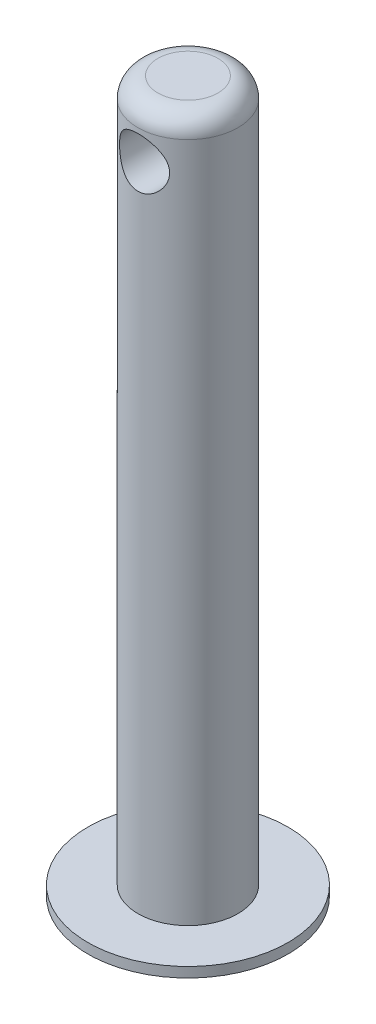
ISO-10303-21;
HEADER;
FILE_DESCRIPTION(('STEP AP214'),'2;1');
FILE_NAME('part.step','',(''),(''),'','','');
FILE_SCHEMA(('AUTOMOTIVE_DESIGN { 1 0 10303 214 1 1 1 1 }'));
ENDSEC;
DATA;
#1=APPLICATION_CONTEXT('core data for automotive mechanical design processes');
#2=APPLICATION_PROTOCOL_DEFINITION('international standard','automotive_design',2000,#1);
#3=PRODUCT_CONTEXT('',#1,'mechanical');
#4=PRODUCT('Part','Part','',(#3));
#5=PRODUCT_RELATED_PRODUCT_CATEGORY('part','',(#4));
#6=PRODUCT_DEFINITION_FORMATION('','',#4);
#7=PRODUCT_DEFINITION_CONTEXT('part definition',#1,'design');
#8=PRODUCT_DEFINITION('design','',#6,#7);
#9=PRODUCT_DEFINITION_SHAPE('','',#8);
#10=(LENGTH_UNIT() NAMED_UNIT(*) SI_UNIT(.MILLI.,.METRE.));
#11=(NAMED_UNIT(*) PLANE_ANGLE_UNIT() SI_UNIT($,.RADIAN.));
#12=(NAMED_UNIT(*) SI_UNIT($,.STERADIAN.) SOLID_ANGLE_UNIT());
#13=UNCERTAINTY_MEASURE_WITH_UNIT(LENGTH_MEASURE(1.E-05),#10,'distance_accuracy_value','');
#14=(GEOMETRIC_REPRESENTATION_CONTEXT(3) GLOBAL_UNCERTAINTY_ASSIGNED_CONTEXT((#13)) GLOBAL_UNIT_ASSIGNED_CONTEXT((#10,
#11,#12)) REPRESENTATION_CONTEXT('',''));
#15=CARTESIAN_POINT('',(0.,0.,0.));
#16=DIRECTION('',(0.,0.,1.));
#17=DIRECTION('',(1.,0.,0.));
#18=AXIS2_PLACEMENT_3D('',#15,#16,#17);
#19=CARTESIAN_POINT('',(0.,70.,0.));
#20=DIRECTION('',(0.,-1.,0.));
#21=DIRECTION('',(0.,0.,-1.));
#22=AXIS2_PLACEMENT_3D('',#19,#20,#21);
#23=CYLINDRICAL_SURFACE('',#22,5.);
#24=CARTESIAN_POINT('',(0.,67.5,-5.));
#25=CARTESIAN_POINT('',(-0.131426682334305,67.499990330944,-4.99999177550472));
#26=CARTESIAN_POINT('',(-0.263015634437213,67.489574438226,-4.99476199135277));
#27=CARTESIAN_POINT('',(-0.522301454622884,67.448368178838,-4.9743541856102));
#28=CARTESIAN_POINT('',(-0.649990448564106,67.417539119075,-4.9591572718767));
#29=CARTESIAN_POINT('',(-0.897333631316202,67.3370153772812,-4.92040690922477));
#30=CARTESIAN_POINT('',(-1.01701694536277,67.2873940122173,-4.89688595907259));
#31=CARTESIAN_POINT('',(-1.2461816039967,67.1710734737482,-4.84364443325827));
#32=CARTESIAN_POINT('',(-1.35566375203769,67.1043756468549,-4.81392434644421));
#33=CARTESIAN_POINT('',(-1.56876952630997,66.9512068683574,-4.74890645050632));
#34=CARTESIAN_POINT('',(-1.67163802294308,66.8637837997702,-4.71337997659091));
#35=CARTESIAN_POINT('',(-1.86194861703332,66.6736963040147,-4.64149925776731));
#36=CARTESIAN_POINT('',(-1.94937895911555,66.5710203711599,-4.60514440566897));
#37=CARTESIAN_POINT('',(-2.11312999967247,66.3437916255547,-4.53247377945621));
#38=CARTESIAN_POINT('',(-2.18806333849064,66.218159753965,-4.49637967412567));
#39=CARTESIAN_POINT('',(-2.31542056761491,65.9540816602046,-4.43214946943555));
#40=CARTESIAN_POINT('',(-2.36786053751683,65.8156446782374,-4.40400769020792));
#41=CARTESIAN_POINT('',(-2.44533110537653,65.5383372364036,-4.36144667591402));
#42=CARTESIAN_POINT('',(-2.47181464267578,65.3999888698204,-4.34630678958452));
#43=CARTESIAN_POINT('',(-2.50106748329741,65.1200529055624,-4.3295472487215));
#44=CARTESIAN_POINT('',(-2.50386022093906,64.9784686478249,-4.3279142335843));
#45=CARTESIAN_POINT('',(-2.48671821792512,64.7142849392091,-4.33777325642937));
#46=CARTESIAN_POINT('',(-2.46946139884055,64.5914399219417,-4.34771909154984));
#47=CARTESIAN_POINT('',(-2.41734962264384,64.3506952265681,-4.37690571834675));
#48=CARTESIAN_POINT('',(-2.38248905974454,64.2327971367369,-4.39614947079454));
#49=CARTESIAN_POINT('',(-2.2955244509646,64.0019271685857,-4.44218691031838));
#50=CARTESIAN_POINT('',(-2.24303766778988,63.8891340030355,-4.46914601659992));
#51=CARTESIAN_POINT('',(-2.12260421917012,63.673414268525,-4.52758510703513));
#52=CARTESIAN_POINT('',(-2.0546506095312,63.5704921609998,-4.55906711950477));
#53=CARTESIAN_POINT('',(-1.89516513728194,63.3636968681419,-4.62782894758213));
#54=CARTESIAN_POINT('',(-1.8017361459232,63.2613578160596,-4.66533775591865));
#55=CARTESIAN_POINT('',(-1.59888894685345,63.0731614535228,-4.73869058251018));
#56=CARTESIAN_POINT('',(-1.48946314143572,62.9873120199153,-4.77453379897003));
#57=CARTESIAN_POINT('',(-1.25129126457963,62.8307858474257,-4.84254968207409));
#58=CARTESIAN_POINT('',(-1.12188397899854,62.7609988188857,-4.87447460405015));
#59=CARTESIAN_POINT('',(-0.851165538721991,62.6447574273925,-4.92894702803108));
#60=CARTESIAN_POINT('',(-0.709863940663166,62.5982845374621,-4.95150197358893));
#61=CARTESIAN_POINT('',(-0.431916229151783,62.5338114907083,-4.98310834353579));
#62=CARTESIAN_POINT('',(-0.295853826370908,62.513771910633,-4.9931234575324));
#63=CARTESIAN_POINT('',(-0.0219489998732904,62.4963381721638,-5.00182533647794));
#64=CARTESIAN_POINT('',(0.115892549675108,62.4989332859015,-5.00051746803426));
#65=CARTESIAN_POINT('',(0.378082429964654,62.5255167210467,-4.98727980633468));
#66=CARTESIAN_POINT('',(0.502648520123704,62.5478313318244,-4.97618114219992));
#67=CARTESIAN_POINT('',(0.74601723075597,62.6105951797384,-4.94555428287529));
#68=CARTESIAN_POINT('',(0.864819214231882,62.6510464161359,-4.92602515837625));
#69=CARTESIAN_POINT('',(1.09722152111965,62.7499961660804,-4.87960628532329));
#70=CARTESIAN_POINT('',(1.21057599249831,62.8089776252823,-4.85252204417873));
#71=CARTESIAN_POINT('',(1.42615340426439,62.9427688391248,-4.7935993579975));
#72=CARTESIAN_POINT('',(1.52837157450204,63.0175853365199,-4.76175888940534));
#73=CARTESIAN_POINT('',(1.72941922315487,63.1894010632909,-4.69270553315086));
#74=CARTESIAN_POINT('',(1.82693019428496,63.2878571709752,-4.65527212009488));
#75=CARTESIAN_POINT('',(2.0046408025722,63.4998128780494,-4.58155978921587));
#76=CARTESIAN_POINT('',(2.08482846428685,63.6133227970699,-4.54528168472407));
#77=CARTESIAN_POINT('',(2.22926978618995,63.8591091354847,-4.4762798054528));
#78=CARTESIAN_POINT('',(2.29256373922244,63.9920281652911,-4.44381323981254));
#79=CARTESIAN_POINT('',(2.39520706511459,64.2687751688825,-4.38935180726746));
#80=CARTESIAN_POINT('',(2.43458729077056,64.412588816,-4.36734345549014));
#81=CARTESIAN_POINT('',(2.48465421767006,64.6922755573629,-4.33903752569351));
#82=CARTESIAN_POINT('',(2.49773248744361,64.827585634119,-4.33143458674096));
#83=CARTESIAN_POINT('',(2.50172288950899,65.0986176673807,-4.32913386592579));
#84=CARTESIAN_POINT('',(2.49264462983266,65.2343394198736,-4.3344304902511));
#85=CARTESIAN_POINT('',(2.45481530197332,65.4887087556169,-4.35594655164663));
#86=CARTESIAN_POINT('',(2.42802074302696,65.6077511817208,-4.37107736338133));
#87=CARTESIAN_POINT('',(2.35793843840544,65.8395202922,-4.40927540337602));
#88=CARTESIAN_POINT('',(2.31464538728732,65.9522449315665,-4.43234518434965));
#89=CARTESIAN_POINT('',(2.20953919315538,66.1765621527197,-4.48571326433412));
#90=CARTESIAN_POINT('',(2.14667719009403,66.287569851735,-4.5163930799845));
#91=CARTESIAN_POINT('',(2.0053780838799,66.4981862432401,-4.58088327077455));
#92=CARTESIAN_POINT('',(1.92693287765888,66.5977889626287,-4.61469526970767));
#93=CARTESIAN_POINT('',(1.74550556946066,66.7953553637496,-4.68655816327011));
#94=CARTESIAN_POINT('',(1.6407002246921,66.8916493641714,-4.7246249151498));
#95=CARTESIAN_POINT('',(1.41539785420684,67.065655849428,-4.79694347383545));
#96=CARTESIAN_POINT('',(1.29489242426332,67.1433583186059,-4.83119321905446));
#97=CARTESIAN_POINT('',(1.03978808878537,67.2780969794841,-4.89245149457782));
#98=CARTESIAN_POINT('',(0.905095560782287,67.3349831677845,-4.91940711437488));
#99=CARTESIAN_POINT('',(0.696328709257349,67.4021838587924,-4.95177960923351));
#100=CARTESIAN_POINT('',(0.625670413494087,67.4215553980018,-4.96122314081874));
#101=CARTESIAN_POINT('',(0.482623997839258,67.4540659483706,-4.97717127275101));
#102=CARTESIAN_POINT('',(0.410236963092404,67.4672087666764,-4.98367766823159));
#103=CARTESIAN_POINT('',(0.281518684621675,67.4847374722846,-4.9923820076613));
#104=CARTESIAN_POINT('',(0.225408499555448,67.4904549365313,-4.99523288466454));
#105=CARTESIAN_POINT('',(0.112875528456291,67.4980883294657,-4.99904367329659));
#106=CARTESIAN_POINT('',(0.056452733838219,67.5000041532255,-5.00000353273198));
#107=CARTESIAN_POINT('',(0.,67.5,-5.));
#108=B_SPLINE_CURVE_WITH_KNOTS('',3,(#24,#25,#26,#27,#28,#29,#30,#31,#32,#33,#34,#35,#36,#37,
#38,#39,#40,#41,#42,#43,#44,#45,#46,#47,#48,#49,#50,#51,#52,#53,#54,#55,#56,#57,#58,#59,#60,#61,
#62,#63,#64,#65,#66,#67,#68,#69,#70,#71,#72,#73,#74,#75,#76,#77,#78,#79,#80,#81,#82,#83,#84,#85,
#86,#87,#88,#89,#90,#91,#92,#93,#94,#95,#96,#97,#98,#99,#100,#101,#102,#103,#104,#105,#106,
#107),.UNSPECIFIED.,.T.,.F.,(4,2,2,2,2,2,2,2,2,2,2,2,2,2,2,2,2,2,2,2,2,2,2,2,2,2,2,2,2,2,2,2,2,
2,2,2,2,2,2,2,2,4),(0.,0.394060643550733,0.788870374272993,1.18215538873074,1.57540940145392,
1.99245439679521,2.40981559413508,2.85954316076882,3.30894869745702,3.73145030350574,
4.15353393322552,4.52514281023302,4.89687009814194,5.27725600421219,5.65781303150554,
6.08662353334696,6.51563836496715,6.96457555536101,7.41315542280699,7.82458226178364,
8.23581411278691,8.61517266265305,8.99457304077329,9.38482140069747,9.77523626870849,
10.2039902661037,10.6330397153795,11.0828670540368,11.53211279863,11.9382326875699,
12.3441764966107,12.7114482562151,13.0788382197025,13.4709114195009,13.8631890285845,
14.303131068923,14.7433095845248,15.1866003415819,15.407934939208,15.6291340766843,
15.7983933645035,15.9676573239323),.UNSPECIFIED.);
#109=CARTESIAN_POINT('',(0.,67.5,-5.));
#110=VERTEX_POINT('',#109);
#111=EDGE_CURVE('E10',#110,#110,#108,.T.);
#112=ORIENTED_EDGE('',*,*,#111,.T.);
#113=EDGE_LOOP('',(#112));
#114=FACE_BOUND('',#113,.T.);
#115=CARTESIAN_POINT('',(2.5,65.,4.33012701892219));
#116=CARTESIAN_POINT('',(2.49998948436432,64.8697334931235,4.33013982272991));
#117=CARTESIAN_POINT('',(2.48974954513168,64.7392972793238,4.33609541965583));
#118=CARTESIAN_POINT('',(2.44930840724944,64.4824310284708,4.35905877051907));
#119=CARTESIAN_POINT('',(2.41906526369545,64.3560099959427,4.37608974726023));
#120=CARTESIAN_POINT('',(2.3402497699757,64.1113710544389,4.41873376871659));
#121=CARTESIAN_POINT('',(2.29177485369963,63.9931134264378,4.44430111338921));
#122=CARTESIAN_POINT('',(2.17816884056414,63.7664394369054,4.50106659111455));
#123=CARTESIAN_POINT('',(2.11303684262671,63.6580236082042,4.53226502875883));
#124=CARTESIAN_POINT('',(1.96166634317253,63.4442356960831,4.59992173524851));
#125=CARTESIAN_POINT('',(1.87413008816917,63.3398521655102,4.63660159331577));
#126=CARTESIAN_POINT('',(1.68313452122751,63.1464790242868,4.70929956727453));
#127=CARTESIAN_POINT('',(1.57966731506051,63.0574970922451,4.74531734512768));
#128=CARTESIAN_POINT('',(1.35122390789081,62.8915821235144,4.81553692452135));
#129=CARTESIAN_POINT('',(1.22526797235894,62.8158655807209,4.84945266064072));
#130=CARTESIAN_POINT('',(0.960392566671153,62.6871478665161,4.90876890230193));
#131=CARTESIAN_POINT('',(0.82148134538999,62.6341323595615,4.93417477954535));
#132=CARTESIAN_POINT('',(0.54511235977353,62.556238346836,4.9720115311507));
#133=CARTESIAN_POINT('',(0.408254476210989,62.5296261841349,4.98523700553425));
#134=CARTESIAN_POINT('',(0.131426571755681,62.4995847032887,5.00018959613973));
#135=CARTESIAN_POINT('',(-0.00854151460650369,62.4961413580046,5.00192366961168));
#136=CARTESIAN_POINT('',(-0.274581311061962,62.5118666849314,4.99407454791405));
#137=CARTESIAN_POINT('',(-0.400802997942672,62.5290950388045,4.98546239730476));
#138=CARTESIAN_POINT('',(-0.648284429795108,62.5822021097601,4.95935613149294));
#139=CARTESIAN_POINT('',(-0.769543802734622,62.6180822224402,4.94186135165964));
#140=CARTESIAN_POINT('',(-1.00577347892407,62.7077064152249,4.89928958219157));
#141=CARTESIAN_POINT('',(-1.120633558788,62.7616907829303,4.87411103823003));
#142=CARTESIAN_POINT('',(-1.33994200378327,62.8856585405036,4.81844114966712));
#143=CARTESIAN_POINT('',(-1.4443866220966,62.9556476582558,4.78794790393709));
#144=CARTESIAN_POINT('',(-1.65043415224549,63.1172383788326,4.72110985998075));
#145=CARTESIAN_POINT('',(-1.7508351875734,63.210257570815,4.68448439995438));
#146=CARTESIAN_POINT('',(-1.93526092574444,63.4114743123254,4.61135851467029));
#147=CARTESIAN_POINT('',(-2.01927302893557,63.5196834306851,4.57485820664072));
#148=CARTESIAN_POINT('',(-2.17376333660553,63.7566204810602,4.50360390231212));
#149=CARTESIAN_POINT('',(-2.24304328744513,63.8862150576355,4.46910799976769));
#150=CARTESIAN_POINT('',(-2.35829778250308,64.1573441783975,4.4093862569644));
#151=CARTESIAN_POINT('',(-2.40429664552722,64.2988660825439,4.38415075115168));
#152=CARTESIAN_POINT('',(-2.4679505275626,64.578036278207,4.34861589542586));
#153=CARTESIAN_POINT('',(-2.48756280529994,64.7151027976088,4.33729139621241));
#154=CARTESIAN_POINT('',(-2.50379236652857,64.9910033537913,4.32794798404024));
#155=CARTESIAN_POINT('',(-2.50042589328757,65.1298360727995,4.32991967223279));
#156=CARTESIAN_POINT('',(-2.47259010835991,65.3891347964468,4.34585841351462));
#157=CARTESIAN_POINT('',(-2.45046954178116,65.5099486277697,4.35848968766635));
#158=CARTESIAN_POINT('',(-2.38924071158112,65.7459194656775,4.39235053878353));
#159=CARTESIAN_POINT('',(-2.35012694655908,65.8610746268669,4.41358290012585));
#160=CARTESIAN_POINT('',(-2.25411897151217,66.0885283272564,4.46340555199141));
#161=CARTESIAN_POINT('',(-2.19648515923163,66.2004475421326,4.49229108107657));
#162=CARTESIAN_POINT('',(-2.0657176600397,66.4136731788488,4.55390298743125));
#163=CARTESIAN_POINT('',(-1.99257601083123,66.5149741087881,4.58663133387872));
#164=CARTESIAN_POINT('',(-1.82209291799636,66.7174469188033,4.65719996140836));
#165=CARTESIAN_POINT('',(-1.72286318078435,66.8169928767722,4.69516457885707));
#166=CARTESIAN_POINT('',(-1.5085112384988,66.9985305950059,4.76835587444746));
#167=CARTESIAN_POINT('',(-1.39338368664989,67.0805164256585,4.80358162519329));
#168=CARTESIAN_POINT('',(-1.14633840638508,67.2264343147909,4.86853404227334));
#169=CARTESIAN_POINT('',(-1.01405774389062,67.2898327952085,4.89809104179855));
#170=CARTESIAN_POINT('',(-0.738805911647338,67.392844759962,4.9470838739847));
#171=CARTESIAN_POINT('',(-0.595844253647071,67.4324791296051,4.96652859191746));
#172=CARTESIAN_POINT('',(-0.317449205674709,67.4834214093564,4.99168770453968));
#173=CARTESIAN_POINT('',(-0.18252860908538,67.4969946858304,4.99849819767838));
#174=CARTESIAN_POINT('',(0.087814964337426,67.5021081674946,5.00105325940467));
#175=CARTESIAN_POINT('',(0.223237748727012,67.4936560856611,4.99680170177041));
#176=CARTESIAN_POINT('',(0.481344982671068,67.4564589696045,4.97834922085637));
#177=CARTESIAN_POINT('',(0.604280801321767,67.4290878283637,4.96482236636807));
#178=CARTESIAN_POINT('',(0.843614873664449,67.3566825502417,4.92980234191731));
#179=CARTESIAN_POINT('',(0.960012187087208,67.3116458803664,4.90830802955518));
#180=CARTESIAN_POINT('',(1.18855854199592,67.2031821812607,4.85814826741488));
#181=CARTESIAN_POINT('',(1.30031295715362,67.1390509753102,4.82921542506803));
#182=CARTESIAN_POINT('',(1.51193650408535,66.9951058898524,4.76720333344986));
#183=CARTESIAN_POINT('',(1.61180014305397,66.9152848073731,4.73412218229104));
#184=CARTESIAN_POINT('',(1.80728542324369,66.7330042055506,4.66321523550925));
#185=CARTESIAN_POINT('',(1.90149582349002,66.6290822739993,4.62524489658367));
#186=CARTESIAN_POINT('',(2.07165660492503,66.4063847146178,4.55157698284941));
#187=CARTESIAN_POINT('',(2.1475908315154,66.2875960858008,4.51588143910584));
#188=CARTESIAN_POINT('',(2.28108393396028,66.0333638823358,4.44998982823926));
#189=CARTESIAN_POINT('',(2.3379862797745,65.8975126115754,4.42000320346984));
#190=CARTESIAN_POINT('',(2.40494911880459,65.6867773504802,4.38370272660093));
#191=CARTESIAN_POINT('',(2.42419582683991,65.6154402243024,4.37305486646054));
#192=CARTESIAN_POINT('',(2.45635087255789,65.4709593031507,4.35507574170935));
#193=CARTESIAN_POINT('',(2.46926364179177,65.3978168090456,4.34774215854234));
#194=CARTESIAN_POINT('',(2.48591166201423,65.2704990134531,4.3382377954292));
#195=CARTESIAN_POINT('',(2.49118864979203,65.2165836784878,4.33520487024791));
#196=CARTESIAN_POINT('',(2.49823512543934,65.1084553836896,4.33114674911323));
#197=CARTESIAN_POINT('',(2.50000437866475,65.0542424041894,4.33012168747261));
#198=CARTESIAN_POINT('',(2.5,65.,4.33012701892219));
#199=B_SPLINE_CURVE_WITH_KNOTS('',3,(#115,#116,#117,#118,#119,#120,#121,#122,#123,#124,#125,
#126,#127,#128,#129,#130,#131,#132,#133,#134,#135,#136,#137,#138,#139,#140,#141,#142,#143,#144,
#145,#146,#147,#148,#149,#150,#151,#152,#153,#154,#155,#156,#157,#158,#159,#160,#161,#162,#163,
#164,#165,#166,#167,#168,#169,#170,#171,#172,#173,#174,#175,#176,#177,#178,#179,#180,#181,#182,
#183,#184,#185,#186,#187,#188,#189,#190,#191,#192,#193,#194,#195,#196,#197,#198),.UNSPECIFIED.,
.T.,.F.,(4,2,2,2,2,2,2,2,2,2,2,2,2,2,2,2,2,2,2,2,2,2,2,2,2,2,2,2,2,2,2,2,2,2,2,2,2,2,2,2,2,4),
(0.,0.390580306486788,0.781982232062008,1.17132148982694,1.56068181366371,1.98215578129642,
2.40383927716011,2.85394730601992,3.30377067414811,3.72158712424921,4.13915059220183,
4.52040243716429,4.90168281298721,5.2882383683295,5.67493248380763,6.09817978647308,
6.52175120619879,6.97222104328704,7.42221935534346,7.83655727140611,8.25060232976016,
8.61935458565148,8.98822631095241,9.37418241020303,9.76033715555202,10.1951685895662,
10.6301466245059,11.076604535375,11.5226694952701,11.927806759788,12.3328021699001,
12.7111106218382,13.0894733378512,13.4840187680376,13.8787457525688,14.3127560463025,
14.7471485711797,15.195268726016,15.4189244153949,15.6424233996907,15.8050484542806,
15.9676843870379),.UNSPECIFIED.);
#200=CARTESIAN_POINT('',(2.5,65.,4.33012701892219));
#201=VERTEX_POINT('',#200);
#202=EDGE_CURVE('E43',#201,#201,#199,.T.);
#203=ORIENTED_EDGE('',*,*,#202,.T.);
#204=EDGE_LOOP('',(#203));
#205=FACE_BOUND('',#204,.T.);
#206=CARTESIAN_POINT('',(0.,68.,0.));
#207=DIRECTION('',(0.,1.,0.));
#208=DIRECTION('',(0.,0.,1.));
#209=AXIS2_PLACEMENT_3D('',#206,#207,#208);
#210=CIRCLE('',#209,5.);
#211=CARTESIAN_POINT('',(0.,68.,5.));
#212=VERTEX_POINT('',#211);
#213=EDGE_CURVE('E47',#212,#212,#210,.F.);
#214=ORIENTED_EDGE('',*,*,#213,.T.);
#215=EDGE_LOOP('',(#214));
#216=FACE_BOUND('',#215,.T.);
#217=CARTESIAN_POINT('',(0.,0.,0.));
#218=DIRECTION('',(0.,-1.,0.));
#219=DIRECTION('',(0.,0.,-1.));
#220=AXIS2_PLACEMENT_3D('',#217,#218,#219);
#221=CIRCLE('',#220,5.);
#222=CARTESIAN_POINT('',(0.,0.,-5.));
#223=VERTEX_POINT('',#222);
#224=EDGE_CURVE('E77',#223,#223,#221,.T.);
#225=ORIENTED_EDGE('',*,*,#224,.F.);
#226=EDGE_LOOP('',(#225));
#227=FACE_BOUND('',#226,.T.);
#228=ADVANCED_FACE('F33',(#114,#205,#216,#227),#23,.T.);
#229=CARTESIAN_POINT('',(0.,70.,0.));
#230=DIRECTION('',(0.,1.,0.));
#231=DIRECTION('',(0.,0.,1.));
#232=AXIS2_PLACEMENT_3D('',#229,#230,#231);
#233=PLANE('',#232);
#234=CARTESIAN_POINT('',(0.,70.,0.));
#235=DIRECTION('',(0.,1.,0.));
#236=DIRECTION('',(0.,0.,1.));
#237=AXIS2_PLACEMENT_3D('',#234,#235,#236);
#238=CIRCLE('',#237,3.);
#239=CARTESIAN_POINT('',(0.,70.,3.));
#240=VERTEX_POINT('',#239);
#241=EDGE_CURVE('E51',#240,#240,#238,.T.);
#242=ORIENTED_EDGE('',*,*,#241,.T.);
#243=EDGE_LOOP('',(#242));
#244=FACE_BOUND('',#243,.T.);
#245=ADVANCED_FACE('F65',(#244),#233,.T.);
#246=CARTESIAN_POINT('',(0.,68.,0.));
#247=DIRECTION('',(0.,1.,0.));
#248=DIRECTION('',(0.,0.,1.));
#249=AXIS2_PLACEMENT_3D('',#246,#247,#248);
#250=TOROIDAL_SURFACE('',#249,3.,2.);
#251=ORIENTED_EDGE('',*,*,#213,.F.);
#252=EDGE_LOOP('',(#251));
#253=FACE_BOUND('',#252,.T.);
#254=ORIENTED_EDGE('',*,*,#241,.F.);
#255=EDGE_LOOP('',(#254));
#256=FACE_BOUND('',#255,.T.);
#257=ADVANCED_FACE('F35',(#253,#256),#250,.T.);
#258=CARTESIAN_POINT('',(0.,65.,-5.));
#259=DIRECTION('',(0.,0.,1.));
#260=DIRECTION('',(1.,0.,0.));
#261=AXIS2_PLACEMENT_3D('',#258,#259,#260);
#262=CYLINDRICAL_SURFACE('',#261,2.5);
#263=ORIENTED_EDGE('',*,*,#202,.F.);
#264=EDGE_LOOP('',(#263));
#265=FACE_BOUND('',#264,.T.);
#266=ORIENTED_EDGE('',*,*,#111,.F.);
#267=EDGE_LOOP('',(#266));
#268=FACE_BOUND('',#267,.T.);
#269=ADVANCED_FACE('F58',(#265,#268),#262,.F.);
#270=CARTESIAN_POINT('',(0.,-1.,0.));
#271=DIRECTION('',(0.,1.,0.));
#272=DIRECTION('',(0.,0.,1.));
#273=AXIS2_PLACEMENT_3D('',#270,#271,#272);
#274=CYLINDRICAL_SURFACE('',#273,10.);
#275=CARTESIAN_POINT('',(0.,-1.,0.));
#276=DIRECTION('',(0.,-1.,0.));
#277=DIRECTION('',(0.,0.,-1.));
#278=AXIS2_PLACEMENT_3D('',#275,#276,#277);
#279=CIRCLE('',#278,10.);
#280=CARTESIAN_POINT('',(0.,-1.,-10.));
#281=VERTEX_POINT('',#280);
#282=EDGE_CURVE('E79',#281,#281,#279,.T.);
#283=ORIENTED_EDGE('',*,*,#282,.F.);
#284=EDGE_LOOP('',(#283));
#285=FACE_BOUND('',#284,.T.);
#286=CARTESIAN_POINT('',(0.,0.,0.));
#287=DIRECTION('',(0.,-1.,0.));
#288=DIRECTION('',(0.,0.,-1.));
#289=AXIS2_PLACEMENT_3D('',#286,#287,#288);
#290=CIRCLE('',#289,10.);
#291=CARTESIAN_POINT('',(0.,0.,-10.));
#292=VERTEX_POINT('',#291);
#293=EDGE_CURVE('E82',#292,#292,#290,.T.);
#294=ORIENTED_EDGE('',*,*,#293,.T.);
#295=EDGE_LOOP('',(#294));
#296=FACE_BOUND('',#295,.T.);
#297=ADVANCED_FACE('F62',(#285,#296),#274,.T.);
#298=CARTESIAN_POINT('',(0.,-1.,0.));
#299=DIRECTION('',(0.,-1.,0.));
#300=DIRECTION('',(0.,0.,-1.));
#301=AXIS2_PLACEMENT_3D('',#298,#299,#300);
#302=PLANE('',#301);
#303=ORIENTED_EDGE('',*,*,#282,.T.);
#304=EDGE_LOOP('',(#303));
#305=FACE_BOUND('',#304,.T.);
#306=ADVANCED_FACE('F88',(#305),#302,.T.);
#307=CARTESIAN_POINT('',(0.,0.,0.));
#308=DIRECTION('',(0.,-1.,0.));
#309=DIRECTION('',(0.,0.,-1.));
#310=AXIS2_PLACEMENT_3D('',#307,#308,#309);
#311=PLANE('',#310);
#312=ORIENTED_EDGE('',*,*,#224,.T.);
#313=EDGE_LOOP('',(#312));
#314=FACE_BOUND('',#313,.T.);
#315=ORIENTED_EDGE('',*,*,#293,.F.);
#316=EDGE_LOOP('',(#315));
#317=FACE_BOUND('',#316,.T.);
#318=ADVANCED_FACE('F94',(#314,#317),#311,.F.);
#319=CLOSED_SHELL('',(#228,#245,#257,#269,#297,#306,#318));
#320=MANIFOLD_SOLID_BREP('B2',#319);
#321=ADVANCED_BREP_SHAPE_REPRESENTATION('',(#18,#320),#14);
#322=SHAPE_DEFINITION_REPRESENTATION(#9,#321);
ENDSEC;
END-ISO-10303-21;
